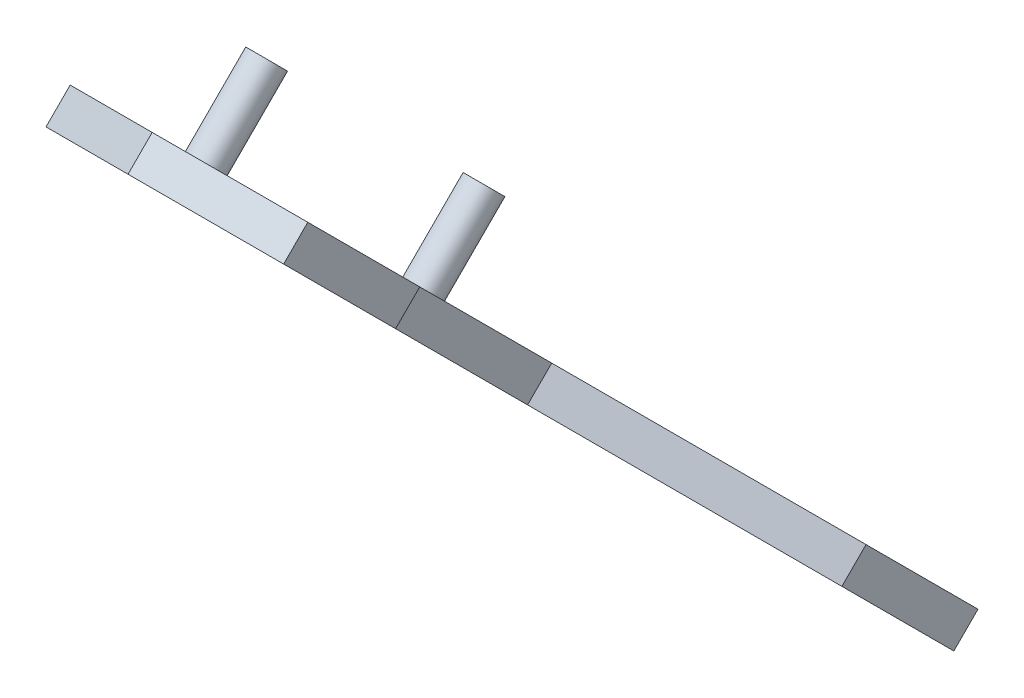
ISO-10303-21;
HEADER;
FILE_DESCRIPTION(('STEP AP214'),'2;1');
FILE_NAME('part.step','',(''),(''),'','','');
FILE_SCHEMA(('AUTOMOTIVE_DESIGN { 1 0 10303 214 1 1 1 1 }'));
ENDSEC;
DATA;
#1=APPLICATION_CONTEXT('core data for automotive mechanical design processes');
#2=APPLICATION_PROTOCOL_DEFINITION('international standard','automotive_design',2000,#1);
#3=PRODUCT_CONTEXT('',#1,'mechanical');
#4=PRODUCT('Part','Part','',(#3));
#5=PRODUCT_RELATED_PRODUCT_CATEGORY('part','',(#4));
#6=PRODUCT_DEFINITION_FORMATION('','',#4);
#7=PRODUCT_DEFINITION_CONTEXT('part definition',#1,'design');
#8=PRODUCT_DEFINITION('design','',#6,#7);
#9=PRODUCT_DEFINITION_SHAPE('','',#8);
#10=(LENGTH_UNIT() NAMED_UNIT(*) SI_UNIT(.MILLI.,.METRE.));
#11=(NAMED_UNIT(*) PLANE_ANGLE_UNIT() SI_UNIT($,.RADIAN.));
#12=(NAMED_UNIT(*) SI_UNIT($,.STERADIAN.) SOLID_ANGLE_UNIT());
#13=UNCERTAINTY_MEASURE_WITH_UNIT(LENGTH_MEASURE(1.E-05),#10,'distance_accuracy_value','');
#14=(GEOMETRIC_REPRESENTATION_CONTEXT(3) GLOBAL_UNCERTAINTY_ASSIGNED_CONTEXT((#13)) GLOBAL_UNIT_ASSIGNED_CONTEXT((#10,
#11,#12)) REPRESENTATION_CONTEXT('',''));
#15=CARTESIAN_POINT('',(0.,0.,0.));
#16=DIRECTION('',(0.,0.,1.));
#17=DIRECTION('',(1.,0.,0.));
#18=AXIS2_PLACEMENT_3D('',#15,#16,#17);
#19=CARTESIAN_POINT('',(-23105.,-18702.3190833892,18702.3190833909));
#20=DIRECTION('',(1.,0.,0.));
#21=DIRECTION('',(0.,0.,-1.));
#22=AXIS2_PLACEMENT_3D('',#19,#20,#21);
#23=PLANE('',#22);
#24=DIRECTION('',(0.,0.70710678118658,0.707106781186515));
#25=VECTOR('',#24,1.);
#26=CARTESIAN_POINT('',(-23105.,-18716.4612190129,18716.4612190146));
#27=LINE('',#26,#25);
#28=CARTESIAN_POINT('',(-23105.,2670.00914348305,40102.9315815086));
#29=VERTEX_POINT('',#28);
#30=CARTESIAN_POINT('',(-23105.,2931.3350890029,40364.2575270285));
#31=VERTEX_POINT('',#30);
#32=EDGE_CURVE('E137',#29,#31,#27,.T.);
#33=ORIENTED_EDGE('',*,*,#32,.T.);
#34=DIRECTION('',(0.,-0.707106781186514,0.707106781186581));
#35=VECTOR('',#34,1.);
#36=CARTESIAN_POINT('',(-23105.,2945.47722462663,40350.1153914047));
#37=LINE('',#36,#35);
#38=CARTESIAN_POINT('',(-23105.,2945.47722462663,40350.1153914047));
#39=VERTEX_POINT('',#38);
#40=EDGE_CURVE('E12',#39,#31,#37,.T.);
#41=ORIENTED_EDGE('',*,*,#40,.F.);
#42=DIRECTION('',(0.,0.70710678118658,0.707106781186515));
#43=VECTOR('',#42,1.);
#44=CARTESIAN_POINT('',(-23105.,-18702.3190833892,18702.3190833909));
#45=LINE('',#44,#43);
#46=CARTESIAN_POINT('',(-23105.,2684.15127910678,40088.7894458849));
#47=VERTEX_POINT('',#46);
#48=EDGE_CURVE('E148',#47,#39,#45,.T.);
#49=ORIENTED_EDGE('',*,*,#48,.F.);
#50=DIRECTION('',(0.,-0.707106781186514,0.707106781186581));
#51=VECTOR('',#50,1.);
#52=CARTESIAN_POINT('',(-23105.,2684.15127910678,40088.7894458849));
#53=LINE('',#52,#51);
#54=EDGE_CURVE('E58',#47,#29,#53,.T.);
#55=ORIENTED_EDGE('',*,*,#54,.T.);
#56=EDGE_LOOP('',(#33,#41,#49,#55));
#57=FACE_BOUND('',#56,.T.);
#58=ADVANCED_FACE('F55',(#57),#23,.F.);
#59=CARTESIAN_POINT('',(-1.18280962818215E-10,2945.47722462656,40350.1153914048));
#60=DIRECTION('',(0.,-0.707106781186581,-0.707106781186514));
#61=DIRECTION('',(0.,0.707106781186514,-0.707106781186581));
#62=AXIS2_PLACEMENT_3D('',#59,#60,#61);
#63=PLANE('',#62);
#64=DIRECTION('',(1.,0.,0.));
#65=VECTOR('',#64,1.);
#66=CARTESIAN_POINT('',(-1.18280962818215E-10,2931.33508900283,40364.2575270285));
#67=LINE('',#66,#65);
#68=CARTESIAN_POINT('',(-22954.8819480886,2931.3350890029,40364.2575270285));
#69=VERTEX_POINT('',#68);
#70=EDGE_CURVE('E100',#31,#69,#67,.T.);
#71=ORIENTED_EDGE('',*,*,#70,.T.);
#72=DIRECTION('',(0.,-0.707106781186514,0.707106781186581));
#73=VECTOR('',#72,1.);
#74=CARTESIAN_POINT('',(-22954.8819480886,2945.47722462663,40350.1153914047));
#75=LINE('',#74,#73);
#76=CARTESIAN_POINT('',(-22954.8819480886,2945.47722462663,40350.1153914047));
#77=VERTEX_POINT('',#76);
#78=EDGE_CURVE('E64',#77,#69,#75,.T.);
#79=ORIENTED_EDGE('',*,*,#78,.F.);
#80=DIRECTION('',(1.,0.,0.));
#81=VECTOR('',#80,1.);
#82=CARTESIAN_POINT('',(-1.18280962818215E-10,2945.47722462656,40350.1153914048));
#83=LINE('',#82,#81);
#84=EDGE_CURVE('E72',#39,#77,#83,.T.);
#85=ORIENTED_EDGE('',*,*,#84,.F.);
#86=ORIENTED_EDGE('',*,*,#40,.T.);
#87=EDGE_LOOP('',(#71,#79,#85,#86));
#88=FACE_BOUND('',#87,.T.);
#89=ADVANCED_FACE('F164',(#88),#63,.F.);
#90=CARTESIAN_POINT('',(-26784.7445411865,237.355414034338,37641.9935808127));
#91=DIRECTION('',(0.70710678118654,-0.500000000000029,-0.499999999999982));
#92=DIRECTION('',(0.577350269189652,0.816496580927708,0.));
#93=AXIS2_PLACEMENT_3D('',#90,#91,#92);
#94=PLANE('',#93);
#95=DIRECTION('',(0.707106781186555,0.500000000000015,0.499999999999975));
#96=VECTOR('',#95,1.);
#97=CARTESIAN_POINT('',(-26784.7445411865,223.213278410608,37656.1357164364));
#98=LINE('',#97,#96);
#99=CARTESIAN_POINT('',(-23062.696263559,2855.09885542478,40288.0212934503));
#100=VERTEX_POINT('',#99);
#101=EDGE_CURVE('E120',#100,#69,#98,.T.);
#102=ORIENTED_EDGE('',*,*,#101,.F.);
#103=DIRECTION('',(0.,-0.707106781186514,0.707106781186581));
#104=VECTOR('',#103,1.);
#105=CARTESIAN_POINT('',(-23062.696263559,2869.24099104851,40273.8791578266));
#106=LINE('',#105,#104);
#107=CARTESIAN_POINT('',(-23062.696263559,2869.24099104851,40273.8791578266));
#108=VERTEX_POINT('',#107);
#109=EDGE_CURVE('E115',#108,#100,#106,.T.);
#110=ORIENTED_EDGE('',*,*,#109,.F.);
#111=DIRECTION('',(0.707106781186555,0.500000000000015,0.499999999999975));
#112=VECTOR('',#111,1.);
#113=CARTESIAN_POINT('',(-26784.7445411865,237.355414034338,37641.9935808127));
#114=LINE('',#113,#112);
#115=EDGE_CURVE('E119',#108,#77,#114,.T.);
#116=ORIENTED_EDGE('',*,*,#115,.T.);
#117=ORIENTED_EDGE('',*,*,#78,.T.);
#118=EDGE_LOOP('',(#102,#110,#116,#117));
#119=FACE_BOUND('',#118,.T.);
#120=ADVANCED_FACE('F117',(#119),#94,.T.);
#121=CARTESIAN_POINT('',(-23062.696263559,-18702.3190833892,18702.3190833909));
#122=DIRECTION('',(-1.,0.,0.));
#123=DIRECTION('',(0.,0.,1.));
#124=AXIS2_PLACEMENT_3D('',#121,#122,#123);
#125=PLANE('',#124);
#126=DIRECTION('',(0.,-0.70710678118658,-0.707106781186515));
#127=VECTOR('',#126,1.);
#128=CARTESIAN_POINT('',(-23062.696263559,-18716.4612190129,18716.4612190146));
#129=LINE('',#128,#127);
#130=CARTESIAN_POINT('',(-23062.696263559,2746.24537706116,40179.1678150867));
#131=VERTEX_POINT('',#130);
#132=EDGE_CURVE('E145',#100,#131,#129,.T.);
#133=ORIENTED_EDGE('',*,*,#132,.T.);
#134=DIRECTION('',(0.,-0.707106781186514,0.707106781186581));
#135=VECTOR('',#134,1.);
#136=CARTESIAN_POINT('',(-23062.696263559,2760.38751268489,40165.025679463));
#137=LINE('',#136,#135);
#138=CARTESIAN_POINT('',(-23062.696263559,2760.38751268489,40165.025679463));
#139=VERTEX_POINT('',#138);
#140=EDGE_CURVE('E124',#139,#131,#137,.T.);
#141=ORIENTED_EDGE('',*,*,#140,.F.);
#142=DIRECTION('',(0.,-0.70710678118658,-0.707106781186515));
#143=VECTOR('',#142,1.);
#144=CARTESIAN_POINT('',(-23062.696263559,-18702.3190833892,18702.3190833909));
#145=LINE('',#144,#143);
#146=EDGE_CURVE('E127',#108,#139,#145,.T.);
#147=ORIENTED_EDGE('',*,*,#146,.F.);
#148=ORIENTED_EDGE('',*,*,#109,.T.);
#149=EDGE_LOOP('',(#133,#141,#147,#148));
#150=FACE_BOUND('',#149,.T.);
#151=ADVANCED_FACE('F128',(#150),#125,.F.);
#152=CARTESIAN_POINT('',(3645.07724492101,-16124.8602455566,21279.7779212234));
#153=DIRECTION('',(0.707106781186546,0.500000000000024,0.499999999999977));
#154=DIRECTION('',(-0.577350269189645,0.816496580927712,0.));
#155=AXIS2_PLACEMENT_3D('',#152,#153,#154);
#156=PLANE('',#155);
#157=DIRECTION('',(-0.707106781186549,0.500000000000024,0.499999999999974));
#158=VECTOR('',#157,1.);
#159=CARTESIAN_POINT('',(3645.07724492101,-16139.0023811804,21293.9200568471));
#160=LINE('',#159,#158);
#161=CARTESIAN_POINT('',(-22954.8819480886,2670.00914348305,40102.9315815086));
#162=VERTEX_POINT('',#161);
#163=EDGE_CURVE('E142',#162,#131,#160,.T.);
#164=ORIENTED_EDGE('',*,*,#163,.F.);
#165=DIRECTION('',(0.,-0.707106781186514,0.707106781186581));
#166=VECTOR('',#165,1.);
#167=CARTESIAN_POINT('',(-22954.8819480886,2684.15127910678,40088.7894458849));
#168=LINE('',#167,#166);
#169=CARTESIAN_POINT('',(-22954.8819480886,2684.15127910678,40088.7894458849));
#170=VERTEX_POINT('',#169);
#171=EDGE_CURVE('E151',#170,#162,#168,.T.);
#172=ORIENTED_EDGE('',*,*,#171,.F.);
#173=DIRECTION('',(-0.707106781186549,0.500000000000024,0.499999999999974));
#174=VECTOR('',#173,1.);
#175=CARTESIAN_POINT('',(3645.07724492101,-16124.8602455566,21279.7779212234));
#176=LINE('',#175,#174);
#177=EDGE_CURVE('E130',#170,#139,#176,.T.);
#178=ORIENTED_EDGE('',*,*,#177,.T.);
#179=ORIENTED_EDGE('',*,*,#140,.T.);
#180=EDGE_LOOP('',(#164,#172,#178,#179));
#181=FACE_BOUND('',#180,.T.);
#182=ADVANCED_FACE('F161',(#181),#156,.T.);
#183=CARTESIAN_POINT('',(-1.18280962818215E-10,2684.15127910671,40088.789445885));
#184=DIRECTION('',(0.,0.707106781186581,0.707106781186514));
#185=DIRECTION('',(0.,-0.707106781186514,0.707106781186581));
#186=AXIS2_PLACEMENT_3D('',#183,#184,#185);
#187=PLANE('',#186);
#188=DIRECTION('',(-1.,0.,0.));
#189=VECTOR('',#188,1.);
#190=CARTESIAN_POINT('',(-1.18280962818215E-10,2670.00914348298,40102.9315815087));
#191=LINE('',#190,#189);
#192=EDGE_CURVE('E140',#162,#29,#191,.T.);
#193=ORIENTED_EDGE('',*,*,#192,.T.);
#194=ORIENTED_EDGE('',*,*,#54,.F.);
#195=DIRECTION('',(-1.,0.,0.));
#196=VECTOR('',#195,1.);
#197=CARTESIAN_POINT('',(-1.18280962818215E-10,2684.15127910671,40088.789445885));
#198=LINE('',#197,#196);
#199=EDGE_CURVE('E107',#170,#47,#198,.T.);
#200=ORIENTED_EDGE('',*,*,#199,.F.);
#201=ORIENTED_EDGE('',*,*,#171,.T.);
#202=EDGE_LOOP('',(#193,#194,#200,#201));
#203=FACE_BOUND('',#202,.T.);
#204=ADVANCED_FACE('F178',(#203),#187,.F.);
#205=CARTESIAN_POINT('',(-1.18280962818214E-10,-18702.3190833893,18702.319083391));
#206=DIRECTION('',(0.,-0.707106781186515,0.70710678118658));
#207=DIRECTION('',(0.,-0.70710678118658,-0.707106781186515));
#208=AXIS2_PLACEMENT_3D('',#205,#206,#207);
#209=PLANE('',#208);
#210=ORIENTED_EDGE('',*,*,#48,.T.);
#211=ORIENTED_EDGE('',*,*,#84,.T.);
#212=ORIENTED_EDGE('',*,*,#115,.F.);
#213=ORIENTED_EDGE('',*,*,#146,.T.);
#214=ORIENTED_EDGE('',*,*,#177,.F.);
#215=ORIENTED_EDGE('',*,*,#199,.T.);
#216=EDGE_LOOP('',(#210,#211,#212,#213,#214,#215));
#217=FACE_BOUND('',#216,.T.);
#218=ADVANCED_FACE('F132',(#217),#209,.F.);
#219=CARTESIAN_POINT('',(-1.18280962818214E-10,-18716.461219013,18716.4612190147));
#220=DIRECTION('',(0.,-0.707106781186515,0.70710678118658));
#221=DIRECTION('',(0.,-0.70710678118658,-0.707106781186515));
#222=AXIS2_PLACEMENT_3D('',#219,#220,#221);
#223=PLANE('',#222);
#224=ORIENTED_EDGE('',*,*,#32,.F.);
#225=ORIENTED_EDGE('',*,*,#192,.F.);
#226=ORIENTED_EDGE('',*,*,#163,.T.);
#227=ORIENTED_EDGE('',*,*,#132,.F.);
#228=ORIENTED_EDGE('',*,*,#101,.T.);
#229=ORIENTED_EDGE('',*,*,#70,.F.);
#230=EDGE_LOOP('',(#224,#225,#226,#227,#228,#229));
#231=FACE_BOUND('',#230,.T.);
#232=ADVANCED_FACE('F158',(#231),#223,.T.);
#233=CLOSED_SHELL('',(#58,#89,#120,#151,#182,#204,#218,#232));
#234=MANIFOLD_SOLID_BREP('B2',#233);
#235=CARTESIAN_POINT('',(-23105.,-18716.4612190129,18716.4612190147));
#236=DIRECTION('',(0.,-0.707106781186514,0.707106781186581));
#237=DIRECTION('',(0.,-0.707106781186581,-0.707106781186514));
#238=AXIS2_PLACEMENT_3D('',#235,#236,#237);
#239=PLANE('',#238);
#240=DIRECTION('',(0.,0.707106781186581,0.707106781186514));
#241=VECTOR('',#240,1.);
#242=CARTESIAN_POINT('',(-23210.,-18716.4612190129,18716.4612190147));
#243=LINE('',#242,#241);
#244=CARTESIAN_POINT('',(-23210.,2720.4154965783,40153.3379346039));
#245=VERTEX_POINT('',#244);
#246=CARTESIAN_POINT('',(-23210.,2880.92873590763,40313.8511739332));
#247=VERTEX_POINT('',#246);
#248=EDGE_CURVE('E354',#245,#247,#243,.T.);
#249=ORIENTED_EDGE('',*,*,#248,.F.);
#250=DIRECTION('',(0.707106781186562,-0.500000000000015,-0.499999999999965));
#251=VECTOR('',#250,1.);
#252=CARTESIAN_POINT('',(3553.16089305426,-16203.9970568872,21228.9253811403));
#253=LINE('',#252,#251);
#254=CARTESIAN_POINT('',(-23046.,2604.4499844637,40037.3724224893));
#255=VERTEX_POINT('',#254);
#256=EDGE_CURVE('E277',#245,#255,#253,.T.);
#257=ORIENTED_EDGE('',*,*,#256,.T.);
#258=DIRECTION('',(-1.,0.,0.));
#259=VECTOR('',#258,1.);
#260=CARTESIAN_POINT('',(-23105.,2604.44998446371,40037.3724224893));
#261=LINE('',#260,#259);
#262=CARTESIAN_POINT('',(-22954.8819480886,2604.44998446369,40037.3724224893));
#263=VERTEX_POINT('',#262);
#264=EDGE_CURVE('E350',#263,#255,#261,.T.);
#265=ORIENTED_EDGE('',*,*,#264,.F.);
#266=DIRECTION('',(0.,0.707106781186586,0.707106781186509));
#267=VECTOR('',#266,1.);
#268=CARTESIAN_POINT('',(-22954.8819480886,2670.00914348304,40102.9315815086));
#269=LINE('',#268,#267);
#270=CARTESIAN_POINT('',(-22954.8819480886,2670.00914348304,40102.9315815086));
#271=VERTEX_POINT('',#270);
#272=EDGE_CURVE('E430',#263,#271,#269,.T.);
#273=ORIENTED_EDGE('',*,*,#272,.T.);
#274=DIRECTION('',(-1.,0.,0.));
#275=VECTOR('',#274,1.);
#276=CARTESIAN_POINT('',(-23105.,2670.00914348304,40102.9315815086));
#277=LINE('',#276,#275);
#278=CARTESIAN_POINT('',(-23105.,2670.00914348304,40102.9315815086));
#279=VERTEX_POINT('',#278);
#280=EDGE_CURVE('E449',#271,#279,#277,.T.);
#281=ORIENTED_EDGE('',*,*,#280,.T.);
#282=DIRECTION('',(0.,0.707106781186581,0.707106781186514));
#283=VECTOR('',#282,1.);
#284=CARTESIAN_POINT('',(-23105.,-18716.4612190129,18716.4612190147));
#285=LINE('',#284,#283);
#286=CARTESIAN_POINT('',(-23105.,2931.3350890029,40364.2575270285));
#287=VERTEX_POINT('',#286);
#288=EDGE_CURVE('E382',#279,#287,#285,.T.);
#289=ORIENTED_EDGE('',*,*,#288,.T.);
#290=DIRECTION('',(1.,0.,0.));
#291=VECTOR('',#290,1.);
#292=CARTESIAN_POINT('',(-23105.,2931.33508900289,40364.2575270285));
#293=LINE('',#292,#291);
#294=CARTESIAN_POINT('',(-22954.8819480886,2931.33508900289,40364.2575270285));
#295=VERTEX_POINT('',#294);
#296=EDGE_CURVE('E422',#287,#295,#293,.T.);
#297=ORIENTED_EDGE('',*,*,#296,.T.);
#298=DIRECTION('',(0.,0.707106781186605,0.70710678118649));
#299=VECTOR('',#298,1.);
#300=CARTESIAN_POINT('',(-22954.8819480886,2996.89424802224,40429.8166860478));
#301=LINE('',#300,#299);
#302=CARTESIAN_POINT('',(-22954.8819480886,2996.89424802224,40429.8166860478));
#303=VERTEX_POINT('',#302);
#304=EDGE_CURVE('E418',#295,#303,#301,.T.);
#305=ORIENTED_EDGE('',*,*,#304,.T.);
#306=DIRECTION('',(-1.,0.,0.));
#307=VECTOR('',#306,1.);
#308=CARTESIAN_POINT('',(-23105.,2996.89424802225,40429.8166860478));
#309=LINE('',#308,#307);
#310=CARTESIAN_POINT('',(-23046.,2996.89424802225,40429.8166860478));
#311=VERTEX_POINT('',#310);
#312=EDGE_CURVE('E362',#303,#311,#309,.T.);
#313=ORIENTED_EDGE('',*,*,#312,.T.);
#314=DIRECTION('',(0.707106781186551,0.500000000000018,0.499999999999977));
#315=VECTOR('',#314,1.);
#316=CARTESIAN_POINT('',(-26876.6608930538,288.207954117691,37721.1303921435));
#317=LINE('',#316,#315);
#318=EDGE_CURVE('E345',#247,#311,#317,.T.);
#319=ORIENTED_EDGE('',*,*,#318,.F.);
#320=EDGE_LOOP('',(#249,#257,#265,#273,#281,#289,#297,#305,#313,#319));
#321=FACE_BOUND('',#320,.T.);
#322=ADVANCED_FACE('F262',(#321),#239,.T.);
#323=CARTESIAN_POINT('',(-23105.,21320.9112034763,21320.9112034796));
#324=DIRECTION('',(0.,-0.707106781186492,-0.707106781186603));
#325=DIRECTION('',(0.,0.707106781186603,-0.707106781186492));
#326=AXIS2_PLACEMENT_3D('',#323,#324,#325);
#327=PLANE('',#326);
#328=ORIENTED_EDGE('',*,*,#264,.T.);
#329=DIRECTION('',(0.,-0.707106781186514,0.707106781186581));
#330=VECTOR('',#329,1.);
#331=CARTESIAN_POINT('',(-23046.,2814.81425186669,39827.0081550863));
#332=LINE('',#331,#330);
#333=CARTESIAN_POINT('',(-23046.,2618.59212008744,40023.2302868655));
#334=VERTEX_POINT('',#333);
#335=EDGE_CURVE('E337',#334,#255,#332,.T.);
#336=ORIENTED_EDGE('',*,*,#335,.F.);
#337=DIRECTION('',(-1.,0.,0.));
#338=VECTOR('',#337,1.);
#339=CARTESIAN_POINT('',(-23105.,2618.59212008744,40023.2302868655));
#340=LINE('',#339,#338);
#341=CARTESIAN_POINT('',(-22954.8819480886,2618.59212008742,40023.2302868656));
#342=VERTEX_POINT('',#341);
#343=EDGE_CURVE('E363',#342,#334,#340,.T.);
#344=ORIENTED_EDGE('',*,*,#343,.F.);
#345=DIRECTION('',(0.,-0.707106781186514,0.707106781186581));
#346=VECTOR('',#345,1.);
#347=CARTESIAN_POINT('',(-22954.8819480886,2618.59212008742,40023.2302868656));
#348=LINE('',#347,#346);
#349=EDGE_CURVE('E359',#342,#263,#348,.T.);
#350=ORIENTED_EDGE('',*,*,#349,.T.);
#351=EDGE_LOOP('',(#328,#336,#344,#350));
#352=FACE_BOUND('',#351,.T.);
#353=ADVANCED_FACE('F357',(#352),#327,.T.);
#354=CARTESIAN_POINT('',(-23105.,-18702.319083389,18702.3190833891));
#355=DIRECTION('',(0.,0.707106781186546,-0.707106781186549));
#356=DIRECTION('',(0.,0.707106781186549,0.707106781186546));
#357=AXIS2_PLACEMENT_3D('',#354,#355,#356);
#358=PLANE('',#357);
#359=CARTESIAN_POINT('',(-23146.2304490389,2879.14180176873,40283.7799685465));
#360=DIRECTION('',(0.,0.707106781186542,-0.707106781186553));
#361=DIRECTION('',(0.,0.707106781186553,0.707106781186542));
#362=AXIS2_PLACEMENT_3D('',#359,#360,#361);
#363=CIRCLE('',#362,10.0000000000037);
#364=CARTESIAN_POINT('',(-23146.2304490389,2886.2128695806,40290.8510363584));
#365=VERTEX_POINT('',#364);
#366=EDGE_CURVE('E467',#365,#365,#363,.T.);
#367=ORIENTED_EDGE('',*,*,#366,.F.);
#368=EDGE_LOOP('',(#367));
#369=FACE_BOUND('',#368,.T.);
#370=CARTESIAN_POINT('',(-23146.230449039,2751.86258115515,40156.5007479329));
#371=DIRECTION('',(0.,0.707106781186542,-0.707106781186553));
#372=DIRECTION('',(0.,0.707106781186553,0.707106781186542));
#373=AXIS2_PLACEMENT_3D('',#370,#371,#372);
#374=CIRCLE('',#373,10.0000000000037);
#375=CARTESIAN_POINT('',(-23146.230449039,2758.93364896702,40163.5718157448));
#376=VERTEX_POINT('',#375);
#377=EDGE_CURVE('E463',#376,#376,#374,.T.);
#378=ORIENTED_EDGE('',*,*,#377,.F.);
#379=EDGE_LOOP('',(#378));
#380=FACE_BOUND('',#379,.T.);
#381=ORIENTED_EDGE('',*,*,#343,.T.);
#382=DIRECTION('',(-0.707106781186562,0.499999999999991,0.499999999999989));
#383=VECTOR('',#382,1.);
#384=CARTESIAN_POINT('',(-7999.33910694556,-8021.00383160537,29383.6343351728));
#385=LINE('',#384,#383);
#386=CARTESIAN_POINT('',(-23210.,2734.55763220203,40139.1957989801));
#387=VERTEX_POINT('',#386);
#388=EDGE_CURVE('E340',#334,#387,#385,.T.);
#389=ORIENTED_EDGE('',*,*,#388,.T.);
#390=DIRECTION('',(0.,-0.707106781186549,-0.707106781186546));
#391=VECTOR('',#390,1.);
#392=CARTESIAN_POINT('',(-23210.,-18702.319083389,18702.3190833891));
#393=LINE('',#392,#391);
#394=CARTESIAN_POINT('',(-23210.,2895.07087153138,40299.7090383095));
#395=VERTEX_POINT('',#394);
#396=EDGE_CURVE('E377',#395,#387,#393,.T.);
#397=ORIENTED_EDGE('',*,*,#396,.F.);
#398=DIRECTION('',(-0.707106781186551,-0.499999999999999,-0.499999999999997));
#399=VECTOR('',#398,1.);
#400=CARTESIAN_POINT('',(-38429.1608930544,-7866.50099991644,29538.1371668617));
#401=LINE('',#400,#399);
#402=CARTESIAN_POINT('',(-23046.,3011.03638364598,40415.6745504241));
#403=VERTEX_POINT('',#402);
#404=EDGE_CURVE('E285',#403,#395,#401,.T.);
#405=ORIENTED_EDGE('',*,*,#404,.F.);
#406=DIRECTION('',(-1.,0.,0.));
#407=VECTOR('',#406,1.);
#408=CARTESIAN_POINT('',(-23105.,3011.03638364598,40415.6745504241));
#409=LINE('',#408,#407);
#410=CARTESIAN_POINT('',(-22954.8819480886,3011.03638364597,40415.6745504241));
#411=VERTEX_POINT('',#410);
#412=EDGE_CURVE('E369',#411,#403,#409,.T.);
#413=ORIENTED_EDGE('',*,*,#412,.F.);
#414=DIRECTION('',(0.,0.707106781186605,0.70710678118649));
#415=VECTOR('',#414,1.);
#416=CARTESIAN_POINT('',(-22954.8819480886,3011.03638364597,40415.6745504241));
#417=LINE('',#416,#415);
#418=CARTESIAN_POINT('',(-22954.8819480886,2945.47722462662,40350.1153914047));
#419=VERTEX_POINT('',#418);
#420=EDGE_CURVE('E403',#419,#411,#417,.T.);
#421=ORIENTED_EDGE('',*,*,#420,.F.);
#422=DIRECTION('',(1.,0.,0.));
#423=VECTOR('',#422,1.);
#424=CARTESIAN_POINT('',(-23105.,2945.47722462662,40350.1153914047));
#425=LINE('',#424,#423);
#426=CARTESIAN_POINT('',(-23105.,2945.47722462662,40350.1153914047));
#427=VERTEX_POINT('',#426);
#428=EDGE_CURVE('E405',#427,#419,#425,.T.);
#429=ORIENTED_EDGE('',*,*,#428,.F.);
#430=DIRECTION('',(0.,-0.707106781186549,-0.707106781186546));
#431=VECTOR('',#430,1.);
#432=CARTESIAN_POINT('',(-23105.,-18702.319083389,18702.3190833891));
#433=LINE('',#432,#431);
#434=CARTESIAN_POINT('',(-23105.,2684.15127910677,40088.7894458849));
#435=VERTEX_POINT('',#434);
#436=EDGE_CURVE('E386',#427,#435,#433,.T.);
#437=ORIENTED_EDGE('',*,*,#436,.T.);
#438=DIRECTION('',(-1.,0.,0.));
#439=VECTOR('',#438,1.);
#440=CARTESIAN_POINT('',(-23105.,2684.15127910677,40088.7894458849));
#441=LINE('',#440,#439);
#442=CARTESIAN_POINT('',(-22954.8819480886,2684.15127910677,40088.7894458849));
#443=VERTEX_POINT('',#442);
#444=EDGE_CURVE('E443',#443,#435,#441,.T.);
#445=ORIENTED_EDGE('',*,*,#444,.F.);
#446=DIRECTION('',(0.,0.707106781186586,0.707106781186509));
#447=VECTOR('',#446,1.);
#448=CARTESIAN_POINT('',(-22954.8819480886,2684.15127910677,40088.7894458849));
#449=LINE('',#448,#447);
#450=EDGE_CURVE('E425',#342,#443,#449,.T.);
#451=ORIENTED_EDGE('',*,*,#450,.F.);
#452=EDGE_LOOP('',(#381,#389,#397,#405,#413,#421,#429,#437,#445,#451));
#453=FACE_BOUND('',#452,.T.);
#454=ADVANCED_FACE('F379',(#369,#380,#453),#358,.T.);
#455=CARTESIAN_POINT('',(-23210.,0.,0.));
#456=DIRECTION('',(1.,0.,0.));
#457=DIRECTION('',(0.,0.,-1.));
#458=AXIS2_PLACEMENT_3D('',#455,#456,#457);
#459=PLANE('',#458);
#460=DIRECTION('',(0.,0.707106781186514,-0.707106781186581));
#461=VECTOR('',#460,1.);
#462=CARTESIAN_POINT('',(-23210.,21436.8767155912,21436.8767155892));
#463=LINE('',#462,#461);
#464=EDGE_CURVE('E53',#245,#387,#463,.T.);
#465=ORIENTED_EDGE('',*,*,#464,.F.);
#466=ORIENTED_EDGE('',*,*,#248,.T.);
#467=DIRECTION('',(0.,0.707106781186514,-0.707106781186581));
#468=VECTOR('',#467,1.);
#469=CARTESIAN_POINT('',(-23210.,21597.3899549206,21597.3899549185));
#470=LINE('',#469,#468);
#471=EDGE_CURVE('E271',#247,#395,#470,.T.);
#472=ORIENTED_EDGE('',*,*,#471,.T.);
#473=ORIENTED_EDGE('',*,*,#396,.T.);
#474=EDGE_LOOP('',(#465,#466,#472,#473));
#475=FACE_BOUND('',#474,.T.);
#476=ADVANCED_FACE('F376',(#475),#459,.F.);
#477=CARTESIAN_POINT('',(-23105.,0.,0.));
#478=DIRECTION('',(1.,0.,0.));
#479=DIRECTION('',(0.,0.,-1.));
#480=AXIS2_PLACEMENT_3D('',#477,#478,#479);
#481=PLANE('',#480);
#482=DIRECTION('',(0.,-0.707106781186514,0.707106781186581));
#483=VECTOR('',#482,1.);
#484=CARTESIAN_POINT('',(-23105.,2684.15127910677,40088.7894458849));
#485=LINE('',#484,#483);
#486=EDGE_CURVE('E440',#435,#279,#485,.T.);
#487=ORIENTED_EDGE('',*,*,#486,.F.);
#488=ORIENTED_EDGE('',*,*,#436,.F.);
#489=DIRECTION('',(0.,-0.707106781186514,0.707106781186581));
#490=VECTOR('',#489,1.);
#491=CARTESIAN_POINT('',(-23105.,2945.47722462662,40350.1153914047));
#492=LINE('',#491,#490);
#493=EDGE_CURVE('E409',#427,#287,#492,.T.);
#494=ORIENTED_EDGE('',*,*,#493,.T.);
#495=ORIENTED_EDGE('',*,*,#288,.F.);
#496=EDGE_LOOP('',(#487,#488,#494,#495));
#497=FACE_BOUND('',#496,.T.);
#498=ADVANCED_FACE('F439',(#497),#481,.T.);
#499=CARTESIAN_POINT('',(-23105.,21713.3554670348,21713.3554670382));
#500=DIRECTION('',(0.,0.707106781186492,0.707106781186603));
#501=DIRECTION('',(0.,-0.707106781186603,0.707106781186492));
#502=AXIS2_PLACEMENT_3D('',#499,#500,#501);
#503=PLANE('',#502);
#504=DIRECTION('',(0.,-0.707106781186514,0.707106781186581));
#505=VECTOR('',#504,1.);
#506=CARTESIAN_POINT('',(-23046.,3207.25851542524,40219.4524186448));
#507=LINE('',#506,#505);
#508=EDGE_CURVE('E398',#403,#311,#507,.T.);
#509=ORIENTED_EDGE('',*,*,#508,.T.);
#510=ORIENTED_EDGE('',*,*,#312,.F.);
#511=DIRECTION('',(0.,-0.707106781186514,0.707106781186581));
#512=VECTOR('',#511,1.);
#513=CARTESIAN_POINT('',(-22954.8819480886,3011.03638364597,40415.6745504241));
#514=LINE('',#513,#512);
#515=EDGE_CURVE('E388',#411,#303,#514,.T.);
#516=ORIENTED_EDGE('',*,*,#515,.F.);
#517=ORIENTED_EDGE('',*,*,#412,.T.);
#518=EDGE_LOOP('',(#509,#510,#516,#517));
#519=FACE_BOUND('',#518,.T.);
#520=ADVANCED_FACE('F264',(#519),#503,.T.);
#521=CARTESIAN_POINT('',(-22954.8819480886,3011.03638364597,40415.6745504241));
#522=DIRECTION('',(1.,0.,0.));
#523=DIRECTION('',(0.,0.,-1.));
#524=AXIS2_PLACEMENT_3D('',#521,#522,#523);
#525=PLANE('',#524);
#526=ORIENTED_EDGE('',*,*,#304,.F.);
#527=DIRECTION('',(0.,-0.707106781186514,0.707106781186581));
#528=VECTOR('',#527,1.);
#529=CARTESIAN_POINT('',(-22954.8819480886,2945.47722462662,40350.1153914047));
#530=LINE('',#529,#528);
#531=EDGE_CURVE('E414',#419,#295,#530,.T.);
#532=ORIENTED_EDGE('',*,*,#531,.F.);
#533=ORIENTED_EDGE('',*,*,#420,.T.);
#534=ORIENTED_EDGE('',*,*,#515,.T.);
#535=EDGE_LOOP('',(#526,#532,#533,#534));
#536=FACE_BOUND('',#535,.T.);
#537=ADVANCED_FACE('F486',(#536),#525,.T.);
#538=CARTESIAN_POINT('',(-23105.,2945.47722462662,40350.1153914047));
#539=DIRECTION('',(0.,-0.707106781186581,-0.707106781186514));
#540=DIRECTION('',(0.,0.707106781186514,-0.707106781186581));
#541=AXIS2_PLACEMENT_3D('',#538,#539,#540);
#542=PLANE('',#541);
#543=ORIENTED_EDGE('',*,*,#296,.F.);
#544=ORIENTED_EDGE('',*,*,#493,.F.);
#545=ORIENTED_EDGE('',*,*,#428,.T.);
#546=ORIENTED_EDGE('',*,*,#531,.T.);
#547=EDGE_LOOP('',(#543,#544,#545,#546));
#548=FACE_BOUND('',#547,.T.);
#549=ADVANCED_FACE('F413',(#548),#542,.T.);
#550=CARTESIAN_POINT('',(-23105.,2684.15127910677,40088.7894458849));
#551=DIRECTION('',(0.,0.707106781186581,0.707106781186514));
#552=DIRECTION('',(0.,-0.707106781186514,0.707106781186581));
#553=AXIS2_PLACEMENT_3D('',#550,#551,#552);
#554=PLANE('',#553);
#555=ORIENTED_EDGE('',*,*,#280,.F.);
#556=DIRECTION('',(0.,-0.707106781186514,0.707106781186581));
#557=VECTOR('',#556,1.);
#558=CARTESIAN_POINT('',(-22954.8819480886,2684.15127910677,40088.7894458849));
#559=LINE('',#558,#557);
#560=EDGE_CURVE('E450',#443,#271,#559,.T.);
#561=ORIENTED_EDGE('',*,*,#560,.F.);
#562=ORIENTED_EDGE('',*,*,#444,.T.);
#563=ORIENTED_EDGE('',*,*,#486,.T.);
#564=EDGE_LOOP('',(#555,#561,#562,#563));
#565=FACE_BOUND('',#564,.T.);
#566=ADVANCED_FACE('F488',(#565),#554,.T.);
#567=CARTESIAN_POINT('',(-22954.8819480886,2684.15127910677,40088.7894458849));
#568=DIRECTION('',(1.,0.,0.));
#569=DIRECTION('',(0.,0.,-1.));
#570=AXIS2_PLACEMENT_3D('',#567,#568,#569);
#571=PLANE('',#570);
#572=ORIENTED_EDGE('',*,*,#272,.F.);
#573=ORIENTED_EDGE('',*,*,#349,.F.);
#574=ORIENTED_EDGE('',*,*,#450,.T.);
#575=ORIENTED_EDGE('',*,*,#560,.T.);
#576=EDGE_LOOP('',(#572,#573,#574,#575));
#577=FACE_BOUND('',#576,.T.);
#578=ADVANCED_FACE('F490',(#577),#571,.T.);
#579=CARTESIAN_POINT('',(-23146.230449039,2787.21792021448,40121.1454088736));
#580=DIRECTION('',(0.,-0.707106781186542,0.707106781186553));
#581=DIRECTION('',(0.,-0.707106781186553,-0.707106781186542));
#582=AXIS2_PLACEMENT_3D('',#579,#580,#581);
#583=CYLINDRICAL_SURFACE('',#582,10.0000000000037);
#584=CARTESIAN_POINT('',(-23146.230449039,2787.21792021448,40121.1454088736));
#585=DIRECTION('',(0.,0.707106781186542,-0.707106781186553));
#586=DIRECTION('',(0.,0.707106781186553,0.707106781186542));
#587=AXIS2_PLACEMENT_3D('',#584,#585,#586);
#588=CIRCLE('',#587,10.0000000000037);
#589=CARTESIAN_POINT('',(-23146.230449039,2794.28898802635,40128.2164766855));
#590=VERTEX_POINT('',#589);
#591=EDGE_CURVE('E460',#590,#590,#588,.T.);
#592=ORIENTED_EDGE('',*,*,#591,.F.);
#593=EDGE_LOOP('',(#592));
#594=FACE_BOUND('',#593,.T.);
#595=ORIENTED_EDGE('',*,*,#377,.T.);
#596=EDGE_LOOP('',(#595));
#597=FACE_BOUND('',#596,.T.);
#598=ADVANCED_FACE('F492',(#594,#597),#583,.T.);
#599=CARTESIAN_POINT('',(-23146.230449039,2787.21792021448,40121.1454088736));
#600=DIRECTION('',(0.,0.707106781186542,-0.707106781186553));
#601=DIRECTION('',(0.,0.707106781186553,0.707106781186542));
#602=AXIS2_PLACEMENT_3D('',#599,#600,#601);
#603=PLANE('',#602);
#604=ORIENTED_EDGE('',*,*,#591,.T.);
#605=EDGE_LOOP('',(#604));
#606=FACE_BOUND('',#605,.T.);
#607=ADVANCED_FACE('F498',(#606),#603,.T.);
#608=CARTESIAN_POINT('',(-23146.2304490389,2914.49714082806,40248.4246294872));
#609=DIRECTION('',(0.,-0.707106781186542,0.707106781186553));
#610=DIRECTION('',(0.,-0.707106781186553,-0.707106781186542));
#611=AXIS2_PLACEMENT_3D('',#608,#609,#610);
#612=CYLINDRICAL_SURFACE('',#611,10.0000000000037);
#613=CARTESIAN_POINT('',(-23146.2304490389,2914.49714082806,40248.4246294872));
#614=DIRECTION('',(0.,0.707106781186542,-0.707106781186553));
#615=DIRECTION('',(0.,0.707106781186553,0.707106781186542));
#616=AXIS2_PLACEMENT_3D('',#613,#614,#615);
#617=CIRCLE('',#616,10.0000000000037);
#618=CARTESIAN_POINT('',(-23146.2304490389,2921.56820863992,40255.4956972991));
#619=VERTEX_POINT('',#618);
#620=EDGE_CURVE('E471',#619,#619,#617,.T.);
#621=ORIENTED_EDGE('',*,*,#620,.F.);
#622=EDGE_LOOP('',(#621));
#623=FACE_BOUND('',#622,.T.);
#624=ORIENTED_EDGE('',*,*,#366,.T.);
#625=EDGE_LOOP('',(#624));
#626=FACE_BOUND('',#625,.T.);
#627=ADVANCED_FACE('F555',(#623,#626),#612,.T.);
#628=CARTESIAN_POINT('',(-23146.2304490389,2914.49714082806,40248.4246294872));
#629=DIRECTION('',(0.,0.707106781186542,-0.707106781186553));
#630=DIRECTION('',(0.,0.707106781186553,0.707106781186542));
#631=AXIS2_PLACEMENT_3D('',#628,#629,#630);
#632=PLANE('',#631);
#633=ORIENTED_EDGE('',*,*,#620,.T.);
#634=EDGE_LOOP('',(#633));
#635=FACE_BOUND('',#634,.T.);
#636=ADVANCED_FACE('F550',(#635),#632,.T.);
#637=CARTESIAN_POINT('',(-26876.6608930538,498.572221520684,37510.7661247404));
#638=DIRECTION('',(0.707106781186544,-0.500000000000026,-0.499999999999979));
#639=DIRECTION('',(0.577350269189647,0.816496580927711,0.));
#640=AXIS2_PLACEMENT_3D('',#637,#638,#639);
#641=PLANE('',#640);
#642=ORIENTED_EDGE('',*,*,#404,.T.);
#643=ORIENTED_EDGE('',*,*,#471,.F.);
#644=ORIENTED_EDGE('',*,*,#318,.T.);
#645=ORIENTED_EDGE('',*,*,#508,.F.);
#646=EDGE_LOOP('',(#642,#643,#644,#645));
#647=FACE_BOUND('',#646,.T.);
#648=ADVANCED_FACE('F485',(#647),#641,.F.);
#649=CARTESIAN_POINT('',(3553.16089305426,-15993.6327894842,21018.5611137373));
#650=DIRECTION('',(-0.707106781186534,-0.500000000000033,-0.499999999999986));
#651=DIRECTION('',(0.577350269189659,-0.816496580927702,0.));
#652=AXIS2_PLACEMENT_3D('',#649,#650,#651);
#653=PLANE('',#652);
#654=ORIENTED_EDGE('',*,*,#335,.T.);
#655=ORIENTED_EDGE('',*,*,#256,.F.);
#656=ORIENTED_EDGE('',*,*,#464,.T.);
#657=ORIENTED_EDGE('',*,*,#388,.F.);
#658=EDGE_LOOP('',(#654,#655,#656,#657));
#659=FACE_BOUND('',#658,.T.);
#660=ADVANCED_FACE('F338',(#659),#653,.T.);
#661=CLOSED_SHELL('',(#322,#353,#454,#476,#498,#520,#537,#549,#566,#578,#598,#607,#627,#636,
#648,#660));
#662=MANIFOLD_SOLID_BREP('B6',#661);
#663=ADVANCED_BREP_SHAPE_REPRESENTATION('',(#18,#234,#662),#14);
#664=SHAPE_DEFINITION_REPRESENTATION(#9,#663);
ENDSEC;
END-ISO-10303-21;
